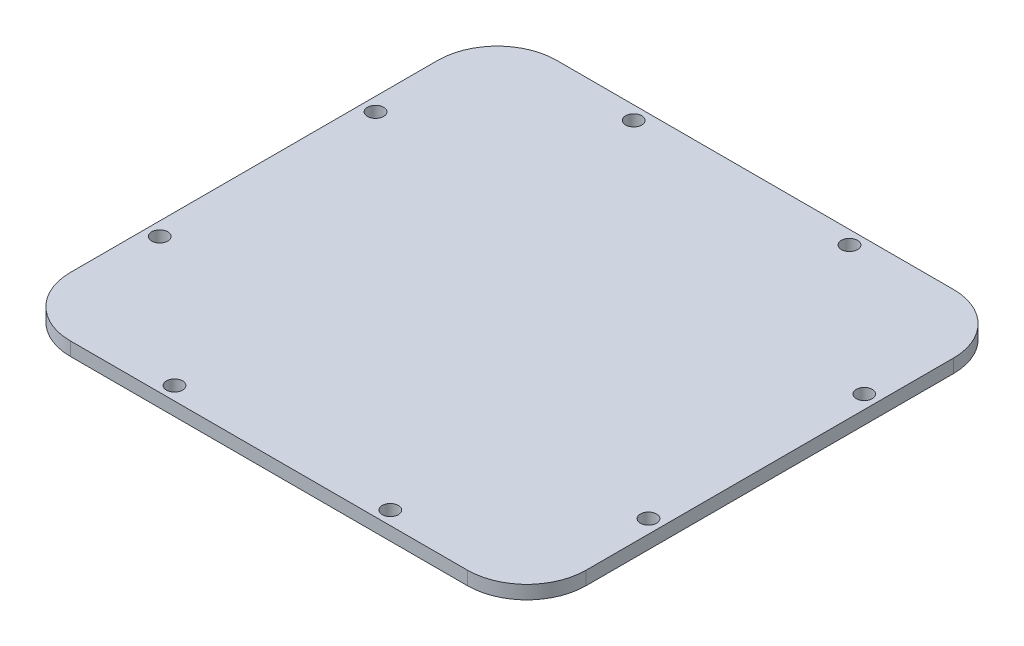
ISO-10303-21;
HEADER;
FILE_DESCRIPTION(('STEP AP214'),'2;1');
FILE_NAME('part.step','',(''),(''),'','','');
FILE_SCHEMA(('AUTOMOTIVE_DESIGN { 1 0 10303 214 1 1 1 1 }'));
ENDSEC;
DATA;
#1=APPLICATION_CONTEXT('core data for automotive mechanical design processes');
#2=APPLICATION_PROTOCOL_DEFINITION('international standard','automotive_design',2000,#1);
#3=PRODUCT_CONTEXT('',#1,'mechanical');
#4=PRODUCT('Part','Part','',(#3));
#5=PRODUCT_RELATED_PRODUCT_CATEGORY('part','',(#4));
#6=PRODUCT_DEFINITION_FORMATION('','',#4);
#7=PRODUCT_DEFINITION_CONTEXT('part definition',#1,'design');
#8=PRODUCT_DEFINITION('design','',#6,#7);
#9=PRODUCT_DEFINITION_SHAPE('','',#8);
#10=(LENGTH_UNIT() NAMED_UNIT(*) SI_UNIT(.MILLI.,.METRE.));
#11=(NAMED_UNIT(*) PLANE_ANGLE_UNIT() SI_UNIT($,.RADIAN.));
#12=(NAMED_UNIT(*) SI_UNIT($,.STERADIAN.) SOLID_ANGLE_UNIT());
#13=UNCERTAINTY_MEASURE_WITH_UNIT(LENGTH_MEASURE(1.E-05),#10,'distance_accuracy_value','');
#14=(GEOMETRIC_REPRESENTATION_CONTEXT(3) GLOBAL_UNCERTAINTY_ASSIGNED_CONTEXT((#13)) GLOBAL_UNIT_ASSIGNED_CONTEXT((#10,
#11,#12)) REPRESENTATION_CONTEXT('',''));
#15=CARTESIAN_POINT('',(0.,0.,0.));
#16=DIRECTION('',(0.,0.,1.));
#17=DIRECTION('',(1.,0.,0.));
#18=AXIS2_PLACEMENT_3D('',#15,#16,#17);
#19=CARTESIAN_POINT('',(0.,0.,0.));
#20=DIRECTION('',(0.,1.,0.));
#21=DIRECTION('',(0.,0.,1.));
#22=AXIS2_PLACEMENT_3D('',#19,#20,#21);
#23=PLANE('',#22);
#24=CARTESIAN_POINT('',(25.4,0.,-54.0512));
#25=DIRECTION('',(0.,-1.,0.));
#26=DIRECTION('',(0.,0.,-1.));
#27=AXIS2_PLACEMENT_3D('',#24,#25,#26);
#28=CIRCLE('',#27,1.89864999999999);
#29=CARTESIAN_POINT('',(25.4,0.,-55.94985));
#30=VERTEX_POINT('',#29);
#31=EDGE_CURVE('E225',#30,#30,#28,.T.);
#32=ORIENTED_EDGE('',*,*,#31,.F.);
#33=EDGE_LOOP('',(#32));
#34=FACE_BOUND('',#33,.T.);
#35=CARTESIAN_POINT('',(57.531,0.,-25.4));
#36=DIRECTION('',(0.,-1.,0.));
#37=DIRECTION('',(0.,0.,-1.));
#38=AXIS2_PLACEMENT_3D('',#35,#36,#37);
#39=CIRCLE('',#38,1.89864999999999);
#40=CARTESIAN_POINT('',(57.531,0.,-27.29865));
#41=VERTEX_POINT('',#40);
#42=EDGE_CURVE('E219',#41,#41,#39,.T.);
#43=ORIENTED_EDGE('',*,*,#42,.F.);
#44=EDGE_LOOP('',(#43));
#45=FACE_BOUND('',#44,.T.);
#46=CARTESIAN_POINT('',(57.531,0.,25.4));
#47=DIRECTION('',(0.,-1.,0.));
#48=DIRECTION('',(0.,0.,-1.));
#49=AXIS2_PLACEMENT_3D('',#46,#47,#48);
#50=CIRCLE('',#49,1.89864999999999);
#51=CARTESIAN_POINT('',(57.531,0.,23.50135));
#52=VERTEX_POINT('',#51);
#53=EDGE_CURVE('E213',#52,#52,#50,.T.);
#54=ORIENTED_EDGE('',*,*,#53,.F.);
#55=EDGE_LOOP('',(#54));
#56=FACE_BOUND('',#55,.T.);
#57=CARTESIAN_POINT('',(-25.4,0.,-54.0512));
#58=DIRECTION('',(0.,-1.,0.));
#59=DIRECTION('',(0.,0.,-1.));
#60=AXIS2_PLACEMENT_3D('',#57,#58,#59);
#61=CIRCLE('',#60,1.89864999999999);
#62=CARTESIAN_POINT('',(-25.4,0.,-55.94985));
#63=VERTEX_POINT('',#62);
#64=EDGE_CURVE('E201',#63,#63,#61,.T.);
#65=ORIENTED_EDGE('',*,*,#64,.F.);
#66=EDGE_LOOP('',(#65));
#67=FACE_BOUND('',#66,.T.);
#68=CARTESIAN_POINT('',(-57.531,0.,-25.4));
#69=DIRECTION('',(0.,-1.,0.));
#70=DIRECTION('',(0.,0.,-1.));
#71=AXIS2_PLACEMENT_3D('',#68,#69,#70);
#72=CIRCLE('',#71,1.89864999999999);
#73=CARTESIAN_POINT('',(-57.531,0.,-27.29865));
#74=VERTEX_POINT('',#73);
#75=EDGE_CURVE('E195',#74,#74,#72,.T.);
#76=ORIENTED_EDGE('',*,*,#75,.F.);
#77=EDGE_LOOP('',(#76));
#78=FACE_BOUND('',#77,.T.);
#79=CARTESIAN_POINT('',(-57.531,0.,25.4));
#80=DIRECTION('',(0.,-1.,0.));
#81=DIRECTION('',(0.,0.,-1.));
#82=AXIS2_PLACEMENT_3D('',#79,#80,#81);
#83=CIRCLE('',#82,1.89864999999999);
#84=CARTESIAN_POINT('',(-57.531,0.,23.50135));
#85=VERTEX_POINT('',#84);
#86=EDGE_CURVE('E189',#85,#85,#83,.T.);
#87=ORIENTED_EDGE('',*,*,#86,.F.);
#88=EDGE_LOOP('',(#87));
#89=FACE_BOUND('',#88,.T.);
#90=CARTESIAN_POINT('',(-25.4,0.,54.0512));
#91=DIRECTION('',(0.,-1.,0.));
#92=DIRECTION('',(0.,0.,-1.));
#93=AXIS2_PLACEMENT_3D('',#90,#91,#92);
#94=CIRCLE('',#93,1.89864999999999);
#95=CARTESIAN_POINT('',(-25.4,0.,52.15255));
#96=VERTEX_POINT('',#95);
#97=EDGE_CURVE('E134',#96,#96,#94,.T.);
#98=ORIENTED_EDGE('',*,*,#97,.F.);
#99=EDGE_LOOP('',(#98));
#100=FACE_BOUND('',#99,.T.);
#101=DIRECTION('',(0.,0.,1.));
#102=VECTOR('',#101,1.);
#103=CARTESIAN_POINT('',(-60.706,0.,57.2262));
#104=LINE('',#103,#102);
#105=CARTESIAN_POINT('',(-60.706,0.,-43.2562));
#106=VERTEX_POINT('',#105);
#107=CARTESIAN_POINT('',(-60.706,0.,43.2562));
#108=VERTEX_POINT('',#107);
#109=EDGE_CURVE('E117',#106,#108,#104,.T.);
#110=ORIENTED_EDGE('',*,*,#109,.F.);
#111=CARTESIAN_POINT('',(-46.736,0.,-43.2562));
#112=DIRECTION('',(0.,1.,0.));
#113=DIRECTION('',(0.,0.,1.));
#114=AXIS2_PLACEMENT_3D('',#111,#112,#113);
#115=CIRCLE('',#114,13.97);
#116=CARTESIAN_POINT('',(-46.736,0.,-57.2262));
#117=VERTEX_POINT('',#116);
#118=EDGE_CURVE('E100',#106,#117,#115,.F.);
#119=ORIENTED_EDGE('',*,*,#118,.T.);
#120=DIRECTION('',(-1.,0.,0.));
#121=VECTOR('',#120,1.);
#122=CARTESIAN_POINT('',(60.706,0.,-57.2262));
#123=LINE('',#122,#121);
#124=CARTESIAN_POINT('',(46.736,0.,-57.2262));
#125=VERTEX_POINT('',#124);
#126=EDGE_CURVE('E141',#125,#117,#123,.T.);
#127=ORIENTED_EDGE('',*,*,#126,.F.);
#128=CARTESIAN_POINT('',(46.736,0.,-43.2562));
#129=DIRECTION('',(0.,1.,0.));
#130=DIRECTION('',(0.,0.,1.));
#131=AXIS2_PLACEMENT_3D('',#128,#129,#130);
#132=CIRCLE('',#131,13.97);
#133=CARTESIAN_POINT('',(60.706,0.,-43.2562));
#134=VERTEX_POINT('',#133);
#135=EDGE_CURVE('E111',#125,#134,#132,.F.);
#136=ORIENTED_EDGE('',*,*,#135,.T.);
#137=DIRECTION('',(0.,0.,-1.));
#138=VECTOR('',#137,1.);
#139=CARTESIAN_POINT('',(60.706,0.,57.2262));
#140=LINE('',#139,#138);
#141=CARTESIAN_POINT('',(60.706,0.,43.2562));
#142=VERTEX_POINT('',#141);
#143=EDGE_CURVE('E131',#142,#134,#140,.T.);
#144=ORIENTED_EDGE('',*,*,#143,.F.);
#145=CARTESIAN_POINT('',(46.736,0.,43.2562));
#146=DIRECTION('',(0.,1.,0.));
#147=DIRECTION('',(0.,0.,1.));
#148=AXIS2_PLACEMENT_3D('',#145,#146,#147);
#149=CIRCLE('',#148,13.97);
#150=CARTESIAN_POINT('',(46.736,0.,57.2262));
#151=VERTEX_POINT('',#150);
#152=EDGE_CURVE('E121',#142,#151,#149,.F.);
#153=ORIENTED_EDGE('',*,*,#152,.T.);
#154=DIRECTION('',(1.,0.,0.));
#155=VECTOR('',#154,1.);
#156=CARTESIAN_POINT('',(60.706,0.,57.2262));
#157=LINE('',#156,#155);
#158=CARTESIAN_POINT('',(-46.736,0.,57.2262));
#159=VERTEX_POINT('',#158);
#160=EDGE_CURVE('E127',#159,#151,#157,.T.);
#161=ORIENTED_EDGE('',*,*,#160,.F.);
#162=CARTESIAN_POINT('',(-46.736,0.,43.2562));
#163=DIRECTION('',(0.,1.,0.));
#164=DIRECTION('',(0.,0.,1.));
#165=AXIS2_PLACEMENT_3D('',#162,#163,#164);
#166=CIRCLE('',#165,13.97);
#167=EDGE_CURVE('E126',#159,#108,#166,.F.);
#168=ORIENTED_EDGE('',*,*,#167,.T.);
#169=EDGE_LOOP('',(#110,#119,#127,#136,#144,#153,#161,#168));
#170=FACE_BOUND('',#169,.T.);
#171=CARTESIAN_POINT('',(25.4,0.,54.0512));
#172=DIRECTION('',(0.,-1.,0.));
#173=DIRECTION('',(0.,0.,-1.));
#174=AXIS2_PLACEMENT_3D('',#171,#172,#173);
#175=CIRCLE('',#174,1.89864999999999);
#176=CARTESIAN_POINT('',(25.4,0.,52.15255));
#177=VERTEX_POINT('',#176);
#178=EDGE_CURVE('E207',#177,#177,#175,.T.);
#179=ORIENTED_EDGE('',*,*,#178,.F.);
#180=EDGE_LOOP('',(#179));
#181=FACE_BOUND('',#180,.T.);
#182=ADVANCED_FACE('F33',(#34,#45,#56,#67,#78,#89,#100,#170,#181),#23,.F.);
#183=CARTESIAN_POINT('',(-60.706,3.175,57.2262));
#184=DIRECTION('',(1.,0.,0.));
#185=DIRECTION('',(0.,0.,-1.));
#186=AXIS2_PLACEMENT_3D('',#183,#184,#185);
#187=PLANE('',#186);
#188=DIRECTION('',(0.,0.,1.));
#189=VECTOR('',#188,1.);
#190=CARTESIAN_POINT('',(-60.706,3.175,57.2262));
#191=LINE('',#190,#189);
#192=CARTESIAN_POINT('',(-60.706,3.175,-43.2562));
#193=VERTEX_POINT('',#192);
#194=CARTESIAN_POINT('',(-60.706,3.175,43.2562));
#195=VERTEX_POINT('',#194);
#196=EDGE_CURVE('E120',#193,#195,#191,.T.);
#197=ORIENTED_EDGE('',*,*,#196,.F.);
#198=DIRECTION('',(0.,-1.,0.));
#199=VECTOR('',#198,1.);
#200=CARTESIAN_POINT('',(-60.706,3.175,-43.2562));
#201=LINE('',#200,#199);
#202=EDGE_CURVE('E104',#193,#106,#201,.T.);
#203=ORIENTED_EDGE('',*,*,#202,.T.);
#204=ORIENTED_EDGE('',*,*,#109,.T.);
#205=DIRECTION('',(0.,-1.,0.));
#206=VECTOR('',#205,1.);
#207=CARTESIAN_POINT('',(-60.706,3.175,43.2562));
#208=LINE('',#207,#206);
#209=EDGE_CURVE('E122',#108,#195,#208,.F.);
#210=ORIENTED_EDGE('',*,*,#209,.T.);
#211=EDGE_LOOP('',(#197,#203,#204,#210));
#212=FACE_BOUND('',#211,.T.);
#213=ADVANCED_FACE('F116',(#212),#187,.F.);
#214=CARTESIAN_POINT('',(60.706,3.175,57.2262));
#215=DIRECTION('',(0.,0.,-1.));
#216=DIRECTION('',(-1.,0.,0.));
#217=AXIS2_PLACEMENT_3D('',#214,#215,#216);
#218=PLANE('',#217);
#219=DIRECTION('',(1.,0.,0.));
#220=VECTOR('',#219,1.);
#221=CARTESIAN_POINT('',(60.706,3.175,57.2262));
#222=LINE('',#221,#220);
#223=CARTESIAN_POINT('',(-46.736,3.175,57.2262));
#224=VERTEX_POINT('',#223);
#225=CARTESIAN_POINT('',(46.736,3.175,57.2262));
#226=VERTEX_POINT('',#225);
#227=EDGE_CURVE('E164',#224,#226,#222,.T.);
#228=ORIENTED_EDGE('',*,*,#227,.F.);
#229=DIRECTION('',(0.,-1.,0.));
#230=VECTOR('',#229,1.);
#231=CARTESIAN_POINT('',(-46.736,3.175,57.2262));
#232=LINE('',#231,#230);
#233=EDGE_CURVE('E11',#224,#159,#232,.T.);
#234=ORIENTED_EDGE('',*,*,#233,.T.);
#235=ORIENTED_EDGE('',*,*,#160,.T.);
#236=DIRECTION('',(0.,-1.,0.));
#237=VECTOR('',#236,1.);
#238=CARTESIAN_POINT('',(46.736,3.175,57.2262));
#239=LINE('',#238,#237);
#240=EDGE_CURVE('E41',#151,#226,#239,.F.);
#241=ORIENTED_EDGE('',*,*,#240,.T.);
#242=EDGE_LOOP('',(#228,#234,#235,#241));
#243=FACE_BOUND('',#242,.T.);
#244=ADVANCED_FACE('F163',(#243),#218,.F.);
#245=CARTESIAN_POINT('',(60.706,3.175,57.2262));
#246=DIRECTION('',(-1.,0.,0.));
#247=DIRECTION('',(0.,0.,1.));
#248=AXIS2_PLACEMENT_3D('',#245,#246,#247);
#249=PLANE('',#248);
#250=ORIENTED_EDGE('',*,*,#143,.T.);
#251=DIRECTION('',(0.,-1.,0.));
#252=VECTOR('',#251,1.);
#253=CARTESIAN_POINT('',(60.706,3.175,-43.2562));
#254=LINE('',#253,#252);
#255=CARTESIAN_POINT('',(60.706,3.175,-43.2562));
#256=VERTEX_POINT('',#255);
#257=EDGE_CURVE('E48',#134,#256,#254,.F.);
#258=ORIENTED_EDGE('',*,*,#257,.T.);
#259=DIRECTION('',(0.,0.,-1.));
#260=VECTOR('',#259,1.);
#261=CARTESIAN_POINT('',(60.706,3.175,57.2262));
#262=LINE('',#261,#260);
#263=CARTESIAN_POINT('',(60.706,3.175,43.2562));
#264=VERTEX_POINT('',#263);
#265=EDGE_CURVE('E170',#264,#256,#262,.T.);
#266=ORIENTED_EDGE('',*,*,#265,.F.);
#267=DIRECTION('',(0.,-1.,0.));
#268=VECTOR('',#267,1.);
#269=CARTESIAN_POINT('',(60.706,3.175,43.2562));
#270=LINE('',#269,#268);
#271=EDGE_CURVE('E157',#264,#142,#270,.T.);
#272=ORIENTED_EDGE('',*,*,#271,.T.);
#273=EDGE_LOOP('',(#250,#258,#266,#272));
#274=FACE_BOUND('',#273,.T.);
#275=ADVANCED_FACE('F174',(#274),#249,.F.);
#276=CARTESIAN_POINT('',(60.706,3.175,-57.2262));
#277=DIRECTION('',(0.,0.,1.));
#278=DIRECTION('',(1.,0.,0.));
#279=AXIS2_PLACEMENT_3D('',#276,#277,#278);
#280=PLANE('',#279);
#281=ORIENTED_EDGE('',*,*,#126,.T.);
#282=DIRECTION('',(0.,-1.,0.));
#283=VECTOR('',#282,1.);
#284=CARTESIAN_POINT('',(-46.736,3.175,-57.2262));
#285=LINE('',#284,#283);
#286=CARTESIAN_POINT('',(-46.736,3.175,-57.2262));
#287=VERTEX_POINT('',#286);
#288=EDGE_CURVE('E105',#117,#287,#285,.F.);
#289=ORIENTED_EDGE('',*,*,#288,.T.);
#290=DIRECTION('',(-1.,0.,0.));
#291=VECTOR('',#290,1.);
#292=CARTESIAN_POINT('',(60.706,3.175,-57.2262));
#293=LINE('',#292,#291);
#294=CARTESIAN_POINT('',(46.736,3.175,-57.2262));
#295=VERTEX_POINT('',#294);
#296=EDGE_CURVE('E137',#295,#287,#293,.T.);
#297=ORIENTED_EDGE('',*,*,#296,.F.);
#298=DIRECTION('',(0.,-1.,0.));
#299=VECTOR('',#298,1.);
#300=CARTESIAN_POINT('',(46.736,3.175,-57.2262));
#301=LINE('',#300,#299);
#302=EDGE_CURVE('E110',#295,#125,#301,.T.);
#303=ORIENTED_EDGE('',*,*,#302,.T.);
#304=EDGE_LOOP('',(#281,#289,#297,#303));
#305=FACE_BOUND('',#304,.T.);
#306=ADVANCED_FACE('F181',(#305),#280,.F.);
#307=CARTESIAN_POINT('',(0.,3.175,0.));
#308=DIRECTION('',(0.,1.,0.));
#309=DIRECTION('',(0.,0.,1.));
#310=AXIS2_PLACEMENT_3D('',#307,#308,#309);
#311=PLANE('',#310);
#312=CARTESIAN_POINT('',(25.4,3.175,-54.0512));
#313=DIRECTION('',(0.,-1.,0.));
#314=DIRECTION('',(0.,0.,-1.));
#315=AXIS2_PLACEMENT_3D('',#312,#313,#314);
#316=CIRCLE('',#315,1.89865);
#317=CARTESIAN_POINT('',(25.4,3.175,-55.94985));
#318=VERTEX_POINT('',#317);
#319=EDGE_CURVE('E222',#318,#318,#316,.T.);
#320=ORIENTED_EDGE('',*,*,#319,.T.);
#321=EDGE_LOOP('',(#320));
#322=FACE_BOUND('',#321,.T.);
#323=CARTESIAN_POINT('',(57.531,3.175,-25.4));
#324=DIRECTION('',(0.,-1.,0.));
#325=DIRECTION('',(0.,0.,-1.));
#326=AXIS2_PLACEMENT_3D('',#323,#324,#325);
#327=CIRCLE('',#326,1.89865);
#328=CARTESIAN_POINT('',(57.531,3.175,-27.29865));
#329=VERTEX_POINT('',#328);
#330=EDGE_CURVE('E216',#329,#329,#327,.T.);
#331=ORIENTED_EDGE('',*,*,#330,.T.);
#332=EDGE_LOOP('',(#331));
#333=FACE_BOUND('',#332,.T.);
#334=CARTESIAN_POINT('',(57.531,3.175,25.4));
#335=DIRECTION('',(0.,-1.,0.));
#336=DIRECTION('',(0.,0.,-1.));
#337=AXIS2_PLACEMENT_3D('',#334,#335,#336);
#338=CIRCLE('',#337,1.89865);
#339=CARTESIAN_POINT('',(57.531,3.175,23.50135));
#340=VERTEX_POINT('',#339);
#341=EDGE_CURVE('E210',#340,#340,#338,.T.);
#342=ORIENTED_EDGE('',*,*,#341,.T.);
#343=EDGE_LOOP('',(#342));
#344=FACE_BOUND('',#343,.T.);
#345=CARTESIAN_POINT('',(25.4,3.175,54.0512));
#346=DIRECTION('',(0.,-1.,0.));
#347=DIRECTION('',(0.,0.,-1.));
#348=AXIS2_PLACEMENT_3D('',#345,#346,#347);
#349=CIRCLE('',#348,1.89865);
#350=CARTESIAN_POINT('',(25.4,3.175,52.15255));
#351=VERTEX_POINT('',#350);
#352=EDGE_CURVE('E204',#351,#351,#349,.T.);
#353=ORIENTED_EDGE('',*,*,#352,.T.);
#354=EDGE_LOOP('',(#353));
#355=FACE_BOUND('',#354,.T.);
#356=CARTESIAN_POINT('',(-25.4,3.175,-54.0512));
#357=DIRECTION('',(0.,-1.,0.));
#358=DIRECTION('',(0.,0.,-1.));
#359=AXIS2_PLACEMENT_3D('',#356,#357,#358);
#360=CIRCLE('',#359,1.89865);
#361=CARTESIAN_POINT('',(-25.4,3.175,-55.94985));
#362=VERTEX_POINT('',#361);
#363=EDGE_CURVE('E198',#362,#362,#360,.T.);
#364=ORIENTED_EDGE('',*,*,#363,.T.);
#365=EDGE_LOOP('',(#364));
#366=FACE_BOUND('',#365,.T.);
#367=CARTESIAN_POINT('',(-57.531,3.175,-25.4));
#368=DIRECTION('',(0.,-1.,0.));
#369=DIRECTION('',(0.,0.,-1.));
#370=AXIS2_PLACEMENT_3D('',#367,#368,#369);
#371=CIRCLE('',#370,1.89865);
#372=CARTESIAN_POINT('',(-57.531,3.175,-27.29865));
#373=VERTEX_POINT('',#372);
#374=EDGE_CURVE('E192',#373,#373,#371,.T.);
#375=ORIENTED_EDGE('',*,*,#374,.T.);
#376=EDGE_LOOP('',(#375));
#377=FACE_BOUND('',#376,.T.);
#378=CARTESIAN_POINT('',(-57.531,3.175,25.4));
#379=DIRECTION('',(0.,-1.,0.));
#380=DIRECTION('',(0.,0.,-1.));
#381=AXIS2_PLACEMENT_3D('',#378,#379,#380);
#382=CIRCLE('',#381,1.89865);
#383=CARTESIAN_POINT('',(-57.531,3.175,23.50135));
#384=VERTEX_POINT('',#383);
#385=EDGE_CURVE('E186',#384,#384,#382,.T.);
#386=ORIENTED_EDGE('',*,*,#385,.T.);
#387=EDGE_LOOP('',(#386));
#388=FACE_BOUND('',#387,.T.);
#389=CARTESIAN_POINT('',(-25.4,3.175,54.0512));
#390=DIRECTION('',(0.,-1.,0.));
#391=DIRECTION('',(0.,0.,-1.));
#392=AXIS2_PLACEMENT_3D('',#389,#390,#391);
#393=CIRCLE('',#392,1.89865);
#394=CARTESIAN_POINT('',(-25.4,3.175,52.15255));
#395=VERTEX_POINT('',#394);
#396=EDGE_CURVE('E128',#395,#395,#393,.T.);
#397=ORIENTED_EDGE('',*,*,#396,.T.);
#398=EDGE_LOOP('',(#397));
#399=FACE_BOUND('',#398,.T.);
#400=ORIENTED_EDGE('',*,*,#296,.T.);
#401=CARTESIAN_POINT('',(-46.736,3.175,-43.2562));
#402=DIRECTION('',(0.,1.,0.));
#403=DIRECTION('',(0.,0.,1.));
#404=AXIS2_PLACEMENT_3D('',#401,#402,#403);
#405=CIRCLE('',#404,13.97);
#406=EDGE_CURVE('E155',#287,#193,#405,.T.);
#407=ORIENTED_EDGE('',*,*,#406,.T.);
#408=ORIENTED_EDGE('',*,*,#196,.T.);
#409=CARTESIAN_POINT('',(-46.736,3.175,43.2562));
#410=DIRECTION('',(0.,1.,0.));
#411=DIRECTION('',(0.,0.,1.));
#412=AXIS2_PLACEMENT_3D('',#409,#410,#411);
#413=CIRCLE('',#412,13.97);
#414=EDGE_CURVE('E151',#195,#224,#413,.T.);
#415=ORIENTED_EDGE('',*,*,#414,.T.);
#416=ORIENTED_EDGE('',*,*,#227,.T.);
#417=CARTESIAN_POINT('',(46.736,3.175,43.2562));
#418=DIRECTION('',(0.,1.,0.));
#419=DIRECTION('',(0.,0.,1.));
#420=AXIS2_PLACEMENT_3D('',#417,#418,#419);
#421=CIRCLE('',#420,13.97);
#422=EDGE_CURVE('E55',#226,#264,#421,.T.);
#423=ORIENTED_EDGE('',*,*,#422,.T.);
#424=ORIENTED_EDGE('',*,*,#265,.T.);
#425=CARTESIAN_POINT('',(46.736,3.175,-43.2562));
#426=DIRECTION('',(0.,1.,0.));
#427=DIRECTION('',(0.,0.,1.));
#428=AXIS2_PLACEMENT_3D('',#425,#426,#427);
#429=CIRCLE('',#428,13.97);
#430=EDGE_CURVE('E153',#256,#295,#429,.T.);
#431=ORIENTED_EDGE('',*,*,#430,.T.);
#432=EDGE_LOOP('',(#400,#407,#408,#415,#416,#423,#424,#431));
#433=FACE_BOUND('',#432,.T.);
#434=ADVANCED_FACE('F168',(#322,#333,#344,#355,#366,#377,#388,#399,#433),#311,.T.);
#435=CARTESIAN_POINT('',(-46.736,3.175,-43.2562));
#436=DIRECTION('',(0.,-1.,0.));
#437=DIRECTION('',(0.,0.,-1.));
#438=AXIS2_PLACEMENT_3D('',#435,#436,#437);
#439=CYLINDRICAL_SURFACE('',#438,13.97);
#440=ORIENTED_EDGE('',*,*,#406,.F.);
#441=ORIENTED_EDGE('',*,*,#288,.F.);
#442=ORIENTED_EDGE('',*,*,#118,.F.);
#443=ORIENTED_EDGE('',*,*,#202,.F.);
#444=EDGE_LOOP('',(#440,#441,#442,#443));
#445=FACE_BOUND('',#444,.T.);
#446=ADVANCED_FACE('F103',(#445),#439,.T.);
#447=CARTESIAN_POINT('',(46.736,3.175,-43.2562));
#448=DIRECTION('',(0.,-1.,0.));
#449=DIRECTION('',(0.,0.,-1.));
#450=AXIS2_PLACEMENT_3D('',#447,#448,#449);
#451=CYLINDRICAL_SURFACE('',#450,13.97);
#452=ORIENTED_EDGE('',*,*,#430,.F.);
#453=ORIENTED_EDGE('',*,*,#257,.F.);
#454=ORIENTED_EDGE('',*,*,#135,.F.);
#455=ORIENTED_EDGE('',*,*,#302,.F.);
#456=EDGE_LOOP('',(#452,#453,#454,#455));
#457=FACE_BOUND('',#456,.T.);
#458=ADVANCED_FACE('F178',(#457),#451,.T.);
#459=CARTESIAN_POINT('',(-46.736,3.175,43.2562));
#460=DIRECTION('',(0.,-1.,0.));
#461=DIRECTION('',(0.,0.,-1.));
#462=AXIS2_PLACEMENT_3D('',#459,#460,#461);
#463=CYLINDRICAL_SURFACE('',#462,13.97);
#464=ORIENTED_EDGE('',*,*,#414,.F.);
#465=ORIENTED_EDGE('',*,*,#209,.F.);
#466=ORIENTED_EDGE('',*,*,#167,.F.);
#467=ORIENTED_EDGE('',*,*,#233,.F.);
#468=EDGE_LOOP('',(#464,#465,#466,#467));
#469=FACE_BOUND('',#468,.T.);
#470=ADVANCED_FACE('F258',(#469),#463,.T.);
#471=CARTESIAN_POINT('',(46.736,3.175,43.2562));
#472=DIRECTION('',(0.,-1.,0.));
#473=DIRECTION('',(0.,0.,-1.));
#474=AXIS2_PLACEMENT_3D('',#471,#472,#473);
#475=CYLINDRICAL_SURFACE('',#474,13.97);
#476=ORIENTED_EDGE('',*,*,#422,.F.);
#477=ORIENTED_EDGE('',*,*,#240,.F.);
#478=ORIENTED_EDGE('',*,*,#152,.F.);
#479=ORIENTED_EDGE('',*,*,#271,.F.);
#480=EDGE_LOOP('',(#476,#477,#478,#479));
#481=FACE_BOUND('',#480,.T.);
#482=ADVANCED_FACE('F35',(#481),#475,.T.);
#483=CARTESIAN_POINT('',(-25.4,0.,54.0512));
#484=DIRECTION('',(0.,-1.,0.));
#485=DIRECTION('',(0.,0.,-1.));
#486=AXIS2_PLACEMENT_3D('',#483,#484,#485);
#487=CYLINDRICAL_SURFACE('',#486,1.89865);
#488=ORIENTED_EDGE('',*,*,#396,.F.);
#489=EDGE_LOOP('',(#488));
#490=FACE_BOUND('',#489,.T.);
#491=ORIENTED_EDGE('',*,*,#97,.T.);
#492=EDGE_LOOP('',(#491));
#493=FACE_BOUND('',#492,.T.);
#494=ADVANCED_FACE('F246',(#490,#493),#487,.F.);
#495=CARTESIAN_POINT('',(-57.531,0.,25.4));
#496=DIRECTION('',(0.,-1.,0.));
#497=DIRECTION('',(0.,0.,-1.));
#498=AXIS2_PLACEMENT_3D('',#495,#496,#497);
#499=CYLINDRICAL_SURFACE('',#498,1.89865);
#500=ORIENTED_EDGE('',*,*,#385,.F.);
#501=EDGE_LOOP('',(#500));
#502=FACE_BOUND('',#501,.T.);
#503=ORIENTED_EDGE('',*,*,#86,.T.);
#504=EDGE_LOOP('',(#503));
#505=FACE_BOUND('',#504,.T.);
#506=ADVANCED_FACE('F248',(#502,#505),#499,.F.);
#507=CARTESIAN_POINT('',(-57.531,0.,-25.4));
#508=DIRECTION('',(0.,-1.,0.));
#509=DIRECTION('',(0.,0.,-1.));
#510=AXIS2_PLACEMENT_3D('',#507,#508,#509);
#511=CYLINDRICAL_SURFACE('',#510,1.89865);
#512=ORIENTED_EDGE('',*,*,#374,.F.);
#513=EDGE_LOOP('',(#512));
#514=FACE_BOUND('',#513,.T.);
#515=ORIENTED_EDGE('',*,*,#75,.T.);
#516=EDGE_LOOP('',(#515));
#517=FACE_BOUND('',#516,.T.);
#518=ADVANCED_FACE('F255',(#514,#517),#511,.F.);
#519=CARTESIAN_POINT('',(-25.4,0.,-54.0512));
#520=DIRECTION('',(0.,-1.,0.));
#521=DIRECTION('',(0.,0.,-1.));
#522=AXIS2_PLACEMENT_3D('',#519,#520,#521);
#523=CYLINDRICAL_SURFACE('',#522,1.89865);
#524=ORIENTED_EDGE('',*,*,#363,.F.);
#525=EDGE_LOOP('',(#524));
#526=FACE_BOUND('',#525,.T.);
#527=ORIENTED_EDGE('',*,*,#64,.T.);
#528=EDGE_LOOP('',(#527));
#529=FACE_BOUND('',#528,.T.);
#530=ADVANCED_FACE('F305',(#526,#529),#523,.F.);
#531=CARTESIAN_POINT('',(25.4,0.,54.0512));
#532=DIRECTION('',(0.,-1.,0.));
#533=DIRECTION('',(0.,0.,-1.));
#534=AXIS2_PLACEMENT_3D('',#531,#532,#533);
#535=CYLINDRICAL_SURFACE('',#534,1.89865);
#536=ORIENTED_EDGE('',*,*,#352,.F.);
#537=EDGE_LOOP('',(#536));
#538=FACE_BOUND('',#537,.T.);
#539=ORIENTED_EDGE('',*,*,#178,.T.);
#540=EDGE_LOOP('',(#539));
#541=FACE_BOUND('',#540,.T.);
#542=ADVANCED_FACE('F314',(#538,#541),#535,.F.);
#543=CARTESIAN_POINT('',(57.531,0.,25.4));
#544=DIRECTION('',(0.,-1.,0.));
#545=DIRECTION('',(0.,0.,-1.));
#546=AXIS2_PLACEMENT_3D('',#543,#544,#545);
#547=CYLINDRICAL_SURFACE('',#546,1.89865);
#548=ORIENTED_EDGE('',*,*,#341,.F.);
#549=EDGE_LOOP('',(#548));
#550=FACE_BOUND('',#549,.T.);
#551=ORIENTED_EDGE('',*,*,#53,.T.);
#552=EDGE_LOOP('',(#551));
#553=FACE_BOUND('',#552,.T.);
#554=ADVANCED_FACE('F338',(#550,#553),#547,.F.);
#555=CARTESIAN_POINT('',(57.531,0.,-25.4));
#556=DIRECTION('',(0.,-1.,0.));
#557=DIRECTION('',(0.,0.,-1.));
#558=AXIS2_PLACEMENT_3D('',#555,#556,#557);
#559=CYLINDRICAL_SURFACE('',#558,1.89865);
#560=ORIENTED_EDGE('',*,*,#330,.F.);
#561=EDGE_LOOP('',(#560));
#562=FACE_BOUND('',#561,.T.);
#563=ORIENTED_EDGE('',*,*,#42,.T.);
#564=EDGE_LOOP('',(#563));
#565=FACE_BOUND('',#564,.T.);
#566=ADVANCED_FACE('F348',(#562,#565),#559,.F.);
#567=CARTESIAN_POINT('',(25.4,0.,-54.0512));
#568=DIRECTION('',(0.,-1.,0.));
#569=DIRECTION('',(0.,0.,-1.));
#570=AXIS2_PLACEMENT_3D('',#567,#568,#569);
#571=CYLINDRICAL_SURFACE('',#570,1.89865);
#572=ORIENTED_EDGE('',*,*,#319,.F.);
#573=EDGE_LOOP('',(#572));
#574=FACE_BOUND('',#573,.T.);
#575=ORIENTED_EDGE('',*,*,#31,.T.);
#576=EDGE_LOOP('',(#575));
#577=FACE_BOUND('',#576,.T.);
#578=ADVANCED_FACE('F229',(#574,#577),#571,.F.);
#579=CLOSED_SHELL('',(#182,#213,#244,#275,#306,#434,#446,#458,#470,#482,#494,#506,#518,#530,
#542,#554,#566,#578));
#580=MANIFOLD_SOLID_BREP('B2',#579);
#581=ADVANCED_BREP_SHAPE_REPRESENTATION('',(#18,#580),#14);
#582=SHAPE_DEFINITION_REPRESENTATION(#9,#581);
ENDSEC;
END-ISO-10303-21;
